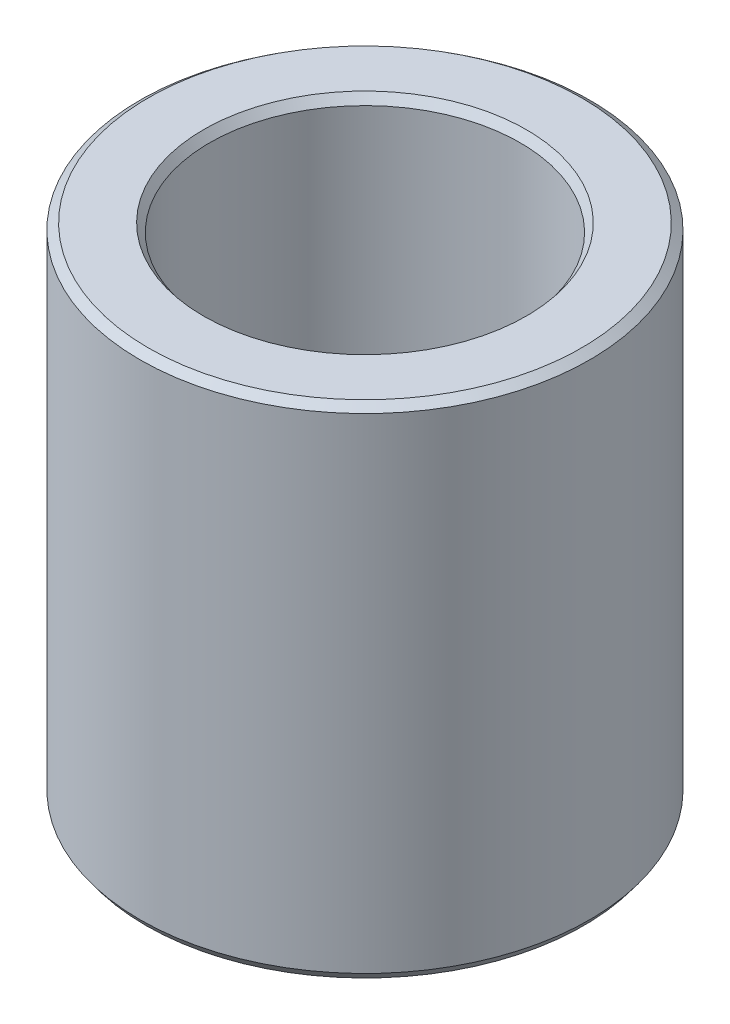
ISO-10303-21;
HEADER;
FILE_DESCRIPTION(('STEP AP214'),'2;1');
FILE_NAME('part.step','',(''),(''),'','','');
FILE_SCHEMA(('AUTOMOTIVE_DESIGN { 1 0 10303 214 1 1 1 1 }'));
ENDSEC;
DATA;
#1=APPLICATION_CONTEXT('core data for automotive mechanical design processes');
#2=APPLICATION_PROTOCOL_DEFINITION('international standard','automotive_design',2000,#1);
#3=PRODUCT_CONTEXT('',#1,'mechanical');
#4=PRODUCT('Part','Part','',(#3));
#5=PRODUCT_RELATED_PRODUCT_CATEGORY('part','',(#4));
#6=PRODUCT_DEFINITION_FORMATION('','',#4);
#7=PRODUCT_DEFINITION_CONTEXT('part definition',#1,'design');
#8=PRODUCT_DEFINITION('design','',#6,#7);
#9=PRODUCT_DEFINITION_SHAPE('','',#8);
#10=(LENGTH_UNIT() NAMED_UNIT(*) SI_UNIT(.MILLI.,.METRE.));
#11=(NAMED_UNIT(*) PLANE_ANGLE_UNIT() SI_UNIT($,.RADIAN.));
#12=(NAMED_UNIT(*) SI_UNIT($,.STERADIAN.) SOLID_ANGLE_UNIT());
#13=UNCERTAINTY_MEASURE_WITH_UNIT(LENGTH_MEASURE(1.E-05),#10,'distance_accuracy_value','');
#14=(GEOMETRIC_REPRESENTATION_CONTEXT(3) GLOBAL_UNCERTAINTY_ASSIGNED_CONTEXT((#13)) GLOBAL_UNIT_ASSIGNED_CONTEXT((#10,
#11,#12)) REPRESENTATION_CONTEXT('',''));
#15=CARTESIAN_POINT('',(0.,0.,0.));
#16=DIRECTION('',(0.,0.,1.));
#17=DIRECTION('',(1.,0.,0.));
#18=AXIS2_PLACEMENT_3D('',#15,#16,#17);
#19=CARTESIAN_POINT('',(0.,33.2994499730218,0.));
#20=DIRECTION('',(0.,-1.,0.));
#21=DIRECTION('',(0.,0.,-1.));
#22=AXIS2_PLACEMENT_3D('',#19,#20,#21);
#23=CYLINDRICAL_SURFACE('',#22,15.);
#24=CARTESIAN_POINT('',(0.,0.551698027445105,0.));
#25=DIRECTION('',(0.,1.,0.));
#26=DIRECTION('',(0.,0.,1.));
#27=AXIS2_PLACEMENT_3D('',#24,#25,#26);
#28=CIRCLE('',#27,15.);
#29=CARTESIAN_POINT('',(0.,0.551698027445105,15.));
#30=VERTEX_POINT('',#29);
#31=EDGE_CURVE('E10',#30,#30,#28,.T.);
#32=ORIENTED_EDGE('',*,*,#31,.T.);
#33=EDGE_LOOP('',(#32));
#34=FACE_BOUND('',#33,.T.);
#35=CARTESIAN_POINT('',(0.,32.8898126179347,0.));
#36=DIRECTION('',(0.,1.,0.));
#37=DIRECTION('',(0.,0.,1.));
#38=AXIS2_PLACEMENT_3D('',#35,#36,#37);
#39=CIRCLE('',#38,15.);
#40=CARTESIAN_POINT('',(0.,32.8898126179347,15.));
#41=VERTEX_POINT('',#40);
#42=EDGE_CURVE('E50',#41,#41,#39,.F.);
#43=ORIENTED_EDGE('',*,*,#42,.T.);
#44=EDGE_LOOP('',(#43));
#45=FACE_BOUND('',#44,.T.);
#46=ADVANCED_FACE('F39',(#34,#45),#23,.T.);
#47=CARTESIAN_POINT('',(0.,33.2994499730218,0.));
#48=DIRECTION('',(0.,1.,0.));
#49=DIRECTION('',(0.,0.,1.));
#50=AXIS2_PLACEMENT_3D('',#47,#48,#49);
#51=PLANE('',#50);
#52=CARTESIAN_POINT('',(0.,33.2994499730218,0.));
#53=DIRECTION('',(0.,1.,0.));
#54=DIRECTION('',(0.,0.,1.));
#55=AXIS2_PLACEMENT_3D('',#52,#53,#54);
#56=CIRCLE('',#55,10.7687030372132);
#57=CARTESIAN_POINT('',(0.,33.2994499730218,10.7687030372132));
#58=VERTEX_POINT('',#57);
#59=EDGE_CURVE('E58',#58,#58,#56,.F.);
#60=ORIENTED_EDGE('',*,*,#59,.T.);
#61=EDGE_LOOP('',(#60));
#62=FACE_BOUND('',#61,.T.);
#63=CARTESIAN_POINT('',(0.,33.2994499730218,0.));
#64=DIRECTION('',(0.,1.,0.));
#65=DIRECTION('',(0.,0.,1.));
#66=AXIS2_PLACEMENT_3D('',#63,#64,#65);
#67=CIRCLE('',#66,14.4483019725549);
#68=CARTESIAN_POINT('',(0.,33.2994499730218,14.4483019725549));
#69=VERTEX_POINT('',#68);
#70=EDGE_CURVE('E61',#69,#69,#67,.T.);
#71=ORIENTED_EDGE('',*,*,#70,.T.);
#72=EDGE_LOOP('',(#71));
#73=FACE_BOUND('',#72,.T.);
#74=ADVANCED_FACE('F88',(#62,#73),#51,.T.);
#75=CARTESIAN_POINT('',(0.,0.,0.));
#76=DIRECTION('',(0.,1.,0.));
#77=DIRECTION('',(0.,0.,1.));
#78=AXIS2_PLACEMENT_3D('',#75,#76,#77);
#79=PLANE('',#78);
#80=CARTESIAN_POINT('',(0.,0.,0.));
#81=DIRECTION('',(0.,1.,0.));
#82=DIRECTION('',(0.,0.,1.));
#83=AXIS2_PLACEMENT_3D('',#80,#81,#82);
#84=CIRCLE('',#83,10.9107637095711);
#85=CARTESIAN_POINT('',(0.,0.,10.9107637095711));
#86=VERTEX_POINT('',#85);
#87=EDGE_CURVE('E51',#86,#86,#84,.T.);
#88=ORIENTED_EDGE('',*,*,#87,.T.);
#89=EDGE_LOOP('',(#88));
#90=FACE_BOUND('',#89,.T.);
#91=CARTESIAN_POINT('',(0.,0.,0.));
#92=DIRECTION('',(0.,1.,0.));
#93=DIRECTION('',(0.,0.,1.));
#94=AXIS2_PLACEMENT_3D('',#91,#92,#93);
#95=CIRCLE('',#94,14.5903626449129);
#96=CARTESIAN_POINT('',(0.,0.,14.5903626449129));
#97=VERTEX_POINT('',#96);
#98=EDGE_CURVE('E54',#97,#97,#95,.F.);
#99=ORIENTED_EDGE('',*,*,#98,.T.);
#100=EDGE_LOOP('',(#99));
#101=FACE_BOUND('',#100,.T.);
#102=ADVANCED_FACE('F83',(#90,#101),#79,.F.);
#103=CARTESIAN_POINT('',(0.,33.2994499730218,0.));
#104=DIRECTION('',(0.,-1.,0.));
#105=DIRECTION('',(0.,0.,-1.));
#106=AXIS2_PLACEMENT_3D('',#103,#104,#105);
#107=CYLINDRICAL_SURFACE('',#106,10.359065682126);
#108=CARTESIAN_POINT('',(0.,32.7477519455766,0.));
#109=DIRECTION('',(0.,1.,0.));
#110=DIRECTION('',(0.,0.,1.));
#111=AXIS2_PLACEMENT_3D('',#108,#109,#110);
#112=CIRCLE('',#111,10.359065682126);
#113=CARTESIAN_POINT('',(0.,32.7477519455766,10.359065682126));
#114=VERTEX_POINT('',#113);
#115=EDGE_CURVE('E67',#114,#114,#112,.T.);
#116=ORIENTED_EDGE('',*,*,#115,.T.);
#117=EDGE_LOOP('',(#116));
#118=FACE_BOUND('',#117,.T.);
#119=CARTESIAN_POINT('',(0.,0.40963735508711,0.));
#120=DIRECTION('',(0.,1.,0.));
#121=DIRECTION('',(0.,0.,1.));
#122=AXIS2_PLACEMENT_3D('',#119,#120,#121);
#123=CIRCLE('',#122,10.359065682126);
#124=CARTESIAN_POINT('',(0.,0.40963735508711,10.359065682126));
#125=VERTEX_POINT('',#124);
#126=EDGE_CURVE('E69',#125,#125,#123,.F.);
#127=ORIENTED_EDGE('',*,*,#126,.T.);
#128=EDGE_LOOP('',(#127));
#129=FACE_BOUND('',#128,.T.);
#130=ADVANCED_FACE('F71',(#118,#129),#107,.F.);
#131=CARTESIAN_POINT('',(0.,32.7477519455766,0.));
#132=DIRECTION('',(0.,1.,0.));
#133=DIRECTION('',(0.,0.,1.));
#134=AXIS2_PLACEMENT_3D('',#131,#132,#133);
#135=CONICAL_SURFACE('',#134,10.359065682126,0.638685637710696);
#136=ORIENTED_EDGE('',*,*,#59,.F.);
#137=EDGE_LOOP('',(#136));
#138=FACE_BOUND('',#137,.T.);
#139=ORIENTED_EDGE('',*,*,#115,.F.);
#140=EDGE_LOOP('',(#139));
#141=FACE_BOUND('',#140,.T.);
#142=ADVANCED_FACE('F77',(#138,#141),#135,.F.);
#143=CARTESIAN_POINT('',(0.,0.,0.));
#144=DIRECTION('',(0.,-1.,0.));
#145=DIRECTION('',(0.,0.,-1.));
#146=AXIS2_PLACEMENT_3D('',#143,#144,#145);
#147=CONICAL_SURFACE('',#146,10.9107637095711,0.932110689084204);
#148=ORIENTED_EDGE('',*,*,#126,.F.);
#149=EDGE_LOOP('',(#148));
#150=FACE_BOUND('',#149,.T.);
#151=ORIENTED_EDGE('',*,*,#87,.F.);
#152=EDGE_LOOP('',(#151));
#153=FACE_BOUND('',#152,.T.);
#154=ADVANCED_FACE('F73',(#150,#153),#147,.F.);
#155=CARTESIAN_POINT('',(0.,0.551698027445105,0.));
#156=DIRECTION('',(0.,1.,0.));
#157=DIRECTION('',(0.,0.,1.));
#158=AXIS2_PLACEMENT_3D('',#155,#156,#157);
#159=CONICAL_SURFACE('',#158,15.,0.638685637710694);
#160=ORIENTED_EDGE('',*,*,#98,.F.);
#161=EDGE_LOOP('',(#160));
#162=FACE_BOUND('',#161,.T.);
#163=ORIENTED_EDGE('',*,*,#31,.F.);
#164=EDGE_LOOP('',(#163));
#165=FACE_BOUND('',#164,.T.);
#166=ADVANCED_FACE('F76',(#162,#165),#159,.T.);
#167=CARTESIAN_POINT('',(0.,33.2994499730218,0.));
#168=DIRECTION('',(0.,-1.,0.));
#169=DIRECTION('',(0.,0.,-1.));
#170=AXIS2_PLACEMENT_3D('',#167,#168,#169);
#171=CONICAL_SURFACE('',#170,14.4483019725549,0.932110689084195);
#172=ORIENTED_EDGE('',*,*,#42,.F.);
#173=EDGE_LOOP('',(#172));
#174=FACE_BOUND('',#173,.T.);
#175=ORIENTED_EDGE('',*,*,#70,.F.);
#176=EDGE_LOOP('',(#175));
#177=FACE_BOUND('',#176,.T.);
#178=ADVANCED_FACE('F45',(#174,#177),#171,.T.);
#179=CLOSED_SHELL('',(#46,#74,#102,#130,#142,#154,#166,#178));
#180=MANIFOLD_SOLID_BREP('B2',#179);
#181=ADVANCED_BREP_SHAPE_REPRESENTATION('',(#18,#180),#14);
#182=SHAPE_DEFINITION_REPRESENTATION(#9,#181);
ENDSEC;
END-ISO-10303-21;
